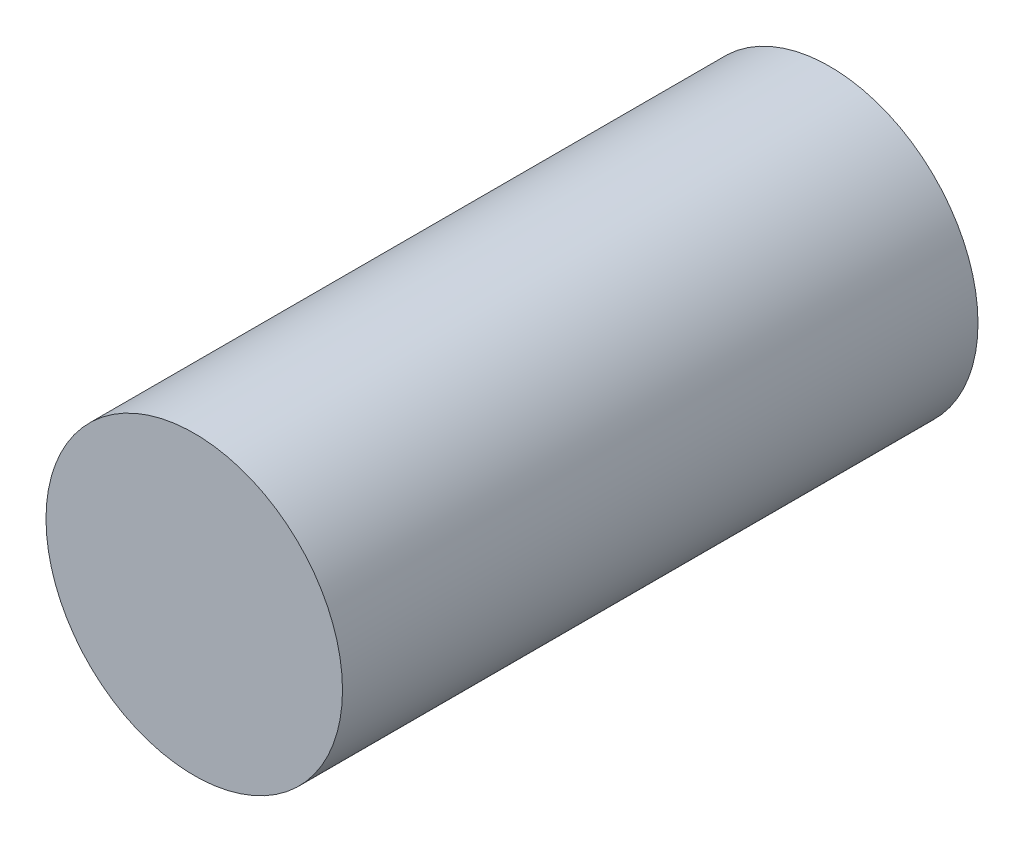
ISO-10303-21;
HEADER;
FILE_DESCRIPTION(('STEP AP214'),'2;1');
FILE_NAME('part.step','',(''),(''),'','','');
FILE_SCHEMA(('AUTOMOTIVE_DESIGN { 1 0 10303 214 1 1 1 1 }'));
ENDSEC;
DATA;
#1=APPLICATION_CONTEXT('core data for automotive mechanical design processes');
#2=APPLICATION_PROTOCOL_DEFINITION('international standard','automotive_design',2000,#1);
#3=PRODUCT_CONTEXT('',#1,'mechanical');
#4=PRODUCT('Part','Part','',(#3));
#5=PRODUCT_RELATED_PRODUCT_CATEGORY('part','',(#4));
#6=PRODUCT_DEFINITION_FORMATION('','',#4);
#7=PRODUCT_DEFINITION_CONTEXT('part definition',#1,'design');
#8=PRODUCT_DEFINITION('design','',#6,#7);
#9=PRODUCT_DEFINITION_SHAPE('','',#8);
#10=(LENGTH_UNIT() NAMED_UNIT(*) SI_UNIT(.MILLI.,.METRE.));
#11=(NAMED_UNIT(*) PLANE_ANGLE_UNIT() SI_UNIT($,.RADIAN.));
#12=(NAMED_UNIT(*) SI_UNIT($,.STERADIAN.) SOLID_ANGLE_UNIT());
#13=UNCERTAINTY_MEASURE_WITH_UNIT(LENGTH_MEASURE(1.E-05),#10,'distance_accuracy_value','');
#14=(GEOMETRIC_REPRESENTATION_CONTEXT(3) GLOBAL_UNCERTAINTY_ASSIGNED_CONTEXT((#13)) GLOBAL_UNIT_ASSIGNED_CONTEXT((#10,
#11,#12)) REPRESENTATION_CONTEXT('',''));
#15=CARTESIAN_POINT('',(0.,0.,0.));
#16=DIRECTION('',(0.,0.,1.));
#17=DIRECTION('',(1.,0.,0.));
#18=AXIS2_PLACEMENT_3D('',#15,#16,#17);
#19=CARTESIAN_POINT('',(0.,0.,163.322));
#20=DIRECTION('',(0.,0.,-1.));
#21=DIRECTION('',(-1.,0.,0.));
#22=AXIS2_PLACEMENT_3D('',#19,#20,#21);
#23=CYLINDRICAL_SURFACE('',#22,38.1);
#24=CARTESIAN_POINT('',(0.,0.,163.322));
#25=DIRECTION('',(0.,0.,1.));
#26=DIRECTION('',(1.,0.,0.));
#27=AXIS2_PLACEMENT_3D('',#24,#25,#26);
#28=CIRCLE('',#27,38.1);
#29=CARTESIAN_POINT('',(38.1,0.,163.322));
#30=VERTEX_POINT('',#29);
#31=EDGE_CURVE('E10',#30,#30,#28,.T.);
#32=ORIENTED_EDGE('',*,*,#31,.F.);
#33=EDGE_LOOP('',(#32));
#34=FACE_BOUND('',#33,.T.);
#35=CARTESIAN_POINT('',(0.,0.,0.));
#36=DIRECTION('',(0.,0.,1.));
#37=DIRECTION('',(1.,0.,0.));
#38=AXIS2_PLACEMENT_3D('',#35,#36,#37);
#39=CIRCLE('',#38,38.1);
#40=CARTESIAN_POINT('',(38.1,0.,0.));
#41=VERTEX_POINT('',#40);
#42=EDGE_CURVE('E33',#41,#41,#39,.T.);
#43=ORIENTED_EDGE('',*,*,#42,.T.);
#44=EDGE_LOOP('',(#43));
#45=FACE_BOUND('',#44,.T.);
#46=ADVANCED_FACE('F30',(#34,#45),#23,.T.);
#47=CARTESIAN_POINT('',(0.,0.,163.322));
#48=DIRECTION('',(0.,0.,1.));
#49=DIRECTION('',(1.,0.,0.));
#50=AXIS2_PLACEMENT_3D('',#47,#48,#49);
#51=PLANE('',#50);
#52=ORIENTED_EDGE('',*,*,#31,.T.);
#53=EDGE_LOOP('',(#52));
#54=FACE_BOUND('',#53,.T.);
#55=ADVANCED_FACE('F45',(#54),#51,.T.);
#56=CARTESIAN_POINT('',(0.,0.,0.));
#57=DIRECTION('',(0.,0.,1.));
#58=DIRECTION('',(1.,0.,0.));
#59=AXIS2_PLACEMENT_3D('',#56,#57,#58);
#60=PLANE('',#59);
#61=ORIENTED_EDGE('',*,*,#42,.F.);
#62=EDGE_LOOP('',(#61));
#63=FACE_BOUND('',#62,.T.);
#64=ADVANCED_FACE('F43',(#63),#60,.F.);
#65=CLOSED_SHELL('',(#46,#55,#64));
#66=MANIFOLD_SOLID_BREP('B2',#65);
#67=ADVANCED_BREP_SHAPE_REPRESENTATION('',(#18,#66),#14);
#68=SHAPE_DEFINITION_REPRESENTATION(#9,#67);
ENDSEC;
END-ISO-10303-21;
